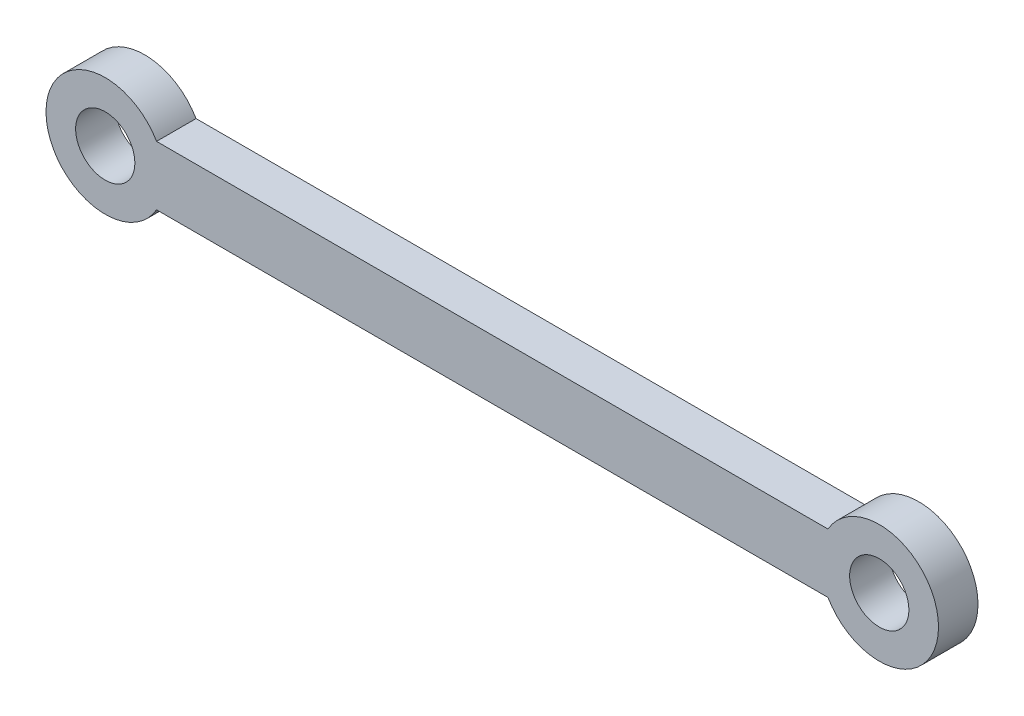
ISO-10303-21;
HEADER;
FILE_DESCRIPTION(('STEP AP214'),'2;1');
FILE_NAME('part.step','',(''),(''),'','','');
FILE_SCHEMA(('AUTOMOTIVE_DESIGN { 1 0 10303 214 1 1 1 1 }'));
ENDSEC;
DATA;
#1=APPLICATION_CONTEXT('core data for automotive mechanical design processes');
#2=APPLICATION_PROTOCOL_DEFINITION('international standard','automotive_design',2000,#1);
#3=PRODUCT_CONTEXT('',#1,'mechanical');
#4=PRODUCT('Part','Part','',(#3));
#5=PRODUCT_RELATED_PRODUCT_CATEGORY('part','',(#4));
#6=PRODUCT_DEFINITION_FORMATION('','',#4);
#7=PRODUCT_DEFINITION_CONTEXT('part definition',#1,'design');
#8=PRODUCT_DEFINITION('design','',#6,#7);
#9=PRODUCT_DEFINITION_SHAPE('','',#8);
#10=(LENGTH_UNIT() NAMED_UNIT(*) SI_UNIT(.MILLI.,.METRE.));
#11=(NAMED_UNIT(*) PLANE_ANGLE_UNIT() SI_UNIT($,.RADIAN.));
#12=(NAMED_UNIT(*) SI_UNIT($,.STERADIAN.) SOLID_ANGLE_UNIT());
#13=UNCERTAINTY_MEASURE_WITH_UNIT(LENGTH_MEASURE(1.E-05),#10,'distance_accuracy_value','');
#14=(GEOMETRIC_REPRESENTATION_CONTEXT(3) GLOBAL_UNCERTAINTY_ASSIGNED_CONTEXT((#13)) GLOBAL_UNIT_ASSIGNED_CONTEXT((#10,
#11,#12)) REPRESENTATION_CONTEXT('',''));
#15=CARTESIAN_POINT('',(0.,0.,0.));
#16=DIRECTION('',(0.,0.,1.));
#17=DIRECTION('',(1.,0.,0.));
#18=AXIS2_PLACEMENT_3D('',#15,#16,#17);
#19=CARTESIAN_POINT('',(-2.59807621135332,1.5,2.));
#20=DIRECTION('',(0.,0.,-1.));
#21=DIRECTION('',(-1.,0.,0.));
#22=AXIS2_PLACEMENT_3D('',#19,#20,#21);
#23=PLANE('',#22);
#24=CARTESIAN_POINT('',(-2.59807621135332,1.5,2.));
#25=DIRECTION('',(0.,0.,1.));
#26=DIRECTION('',(-1.,0.,0.));
#27=AXIS2_PLACEMENT_3D('',#24,#25,#26);
#28=CIRCLE('',#27,3.);
#29=CARTESIAN_POINT('',(0.,3.,2.));
#30=VERTEX_POINT('',#29);
#31=CARTESIAN_POINT('',(0.,0.,2.));
#32=VERTEX_POINT('',#31);
#33=EDGE_CURVE('E85',#30,#32,#28,.T.);
#34=ORIENTED_EDGE('',*,*,#33,.T.);
#35=DIRECTION('',(1.,0.,0.));
#36=VECTOR('',#35,1.);
#37=CARTESIAN_POINT('',(0.,0.,2.));
#38=LINE('',#37,#36);
#39=CARTESIAN_POINT('',(34.,0.,2.));
#40=VERTEX_POINT('',#39);
#41=EDGE_CURVE('E80',#32,#40,#38,.T.);
#42=ORIENTED_EDGE('',*,*,#41,.T.);
#43=CARTESIAN_POINT('',(36.5980762113533,1.5,2.));
#44=DIRECTION('',(0.,0.,1.));
#45=DIRECTION('',(-1.,0.,0.));
#46=AXIS2_PLACEMENT_3D('',#43,#44,#45);
#47=CIRCLE('',#46,3.);
#48=CARTESIAN_POINT('',(34.,3.,2.));
#49=VERTEX_POINT('',#48);
#50=EDGE_CURVE('E83',#40,#49,#47,.T.);
#51=ORIENTED_EDGE('',*,*,#50,.T.);
#52=DIRECTION('',(-1.,0.,0.));
#53=VECTOR('',#52,1.);
#54=CARTESIAN_POINT('',(0.,3.,2.));
#55=LINE('',#54,#53);
#56=EDGE_CURVE('E50',#49,#30,#55,.T.);
#57=ORIENTED_EDGE('',*,*,#56,.T.);
#58=EDGE_LOOP('',(#34,#42,#51,#57));
#59=FACE_BOUND('',#58,.T.);
#60=CARTESIAN_POINT('',(36.5980762113533,1.5,2.));
#61=DIRECTION('',(0.,0.,1.));
#62=DIRECTION('',(1.,0.,0.));
#63=AXIS2_PLACEMENT_3D('',#60,#61,#62);
#64=CIRCLE('',#63,1.5);
#65=CARTESIAN_POINT('',(38.0980762113533,1.5,2.));
#66=VERTEX_POINT('',#65);
#67=EDGE_CURVE('E100',#66,#66,#64,.T.);
#68=ORIENTED_EDGE('',*,*,#67,.F.);
#69=EDGE_LOOP('',(#68));
#70=FACE_BOUND('',#69,.T.);
#71=CARTESIAN_POINT('',(-2.59807621135332,1.5,2.));
#72=DIRECTION('',(0.,0.,1.));
#73=DIRECTION('',(1.,0.,0.));
#74=AXIS2_PLACEMENT_3D('',#71,#72,#73);
#75=CIRCLE('',#74,1.5);
#76=CARTESIAN_POINT('',(-1.09807621135332,1.5,2.));
#77=VERTEX_POINT('',#76);
#78=EDGE_CURVE('E115',#77,#77,#75,.T.);
#79=ORIENTED_EDGE('',*,*,#78,.F.);
#80=EDGE_LOOP('',(#79));
#81=FACE_BOUND('',#80,.T.);
#82=ADVANCED_FACE('F33',(#59,#70,#81),#23,.F.);
#83=CARTESIAN_POINT('',(-2.59807621135332,1.5,0.));
#84=DIRECTION('',(0.,0.,-1.));
#85=DIRECTION('',(-1.,0.,0.));
#86=AXIS2_PLACEMENT_3D('',#83,#84,#85);
#87=PLANE('',#86);
#88=CARTESIAN_POINT('',(36.5980762113533,1.5,0.));
#89=DIRECTION('',(0.,0.,1.));
#90=DIRECTION('',(1.,0.,0.));
#91=AXIS2_PLACEMENT_3D('',#88,#89,#90);
#92=CIRCLE('',#91,1.5);
#93=CARTESIAN_POINT('',(38.0980762113533,1.5,0.));
#94=VERTEX_POINT('',#93);
#95=EDGE_CURVE('E112',#94,#94,#92,.T.);
#96=ORIENTED_EDGE('',*,*,#95,.T.);
#97=EDGE_LOOP('',(#96));
#98=FACE_BOUND('',#97,.T.);
#99=CARTESIAN_POINT('',(-2.59807621135332,1.5,0.));
#100=DIRECTION('',(0.,0.,1.));
#101=DIRECTION('',(-1.,0.,0.));
#102=AXIS2_PLACEMENT_3D('',#99,#100,#101);
#103=CIRCLE('',#102,3.);
#104=CARTESIAN_POINT('',(0.,3.,0.));
#105=VERTEX_POINT('',#104);
#106=CARTESIAN_POINT('',(0.,0.,0.));
#107=VERTEX_POINT('',#106);
#108=EDGE_CURVE('E97',#105,#107,#103,.T.);
#109=ORIENTED_EDGE('',*,*,#108,.F.);
#110=DIRECTION('',(-1.,0.,0.));
#111=VECTOR('',#110,1.);
#112=CARTESIAN_POINT('',(0.,3.,0.));
#113=LINE('',#112,#111);
#114=CARTESIAN_POINT('',(34.,3.,0.));
#115=VERTEX_POINT('',#114);
#116=EDGE_CURVE('E73',#115,#105,#113,.T.);
#117=ORIENTED_EDGE('',*,*,#116,.F.);
#118=CARTESIAN_POINT('',(36.5980762113533,1.5,0.));
#119=DIRECTION('',(0.,0.,1.));
#120=DIRECTION('',(-1.,0.,0.));
#121=AXIS2_PLACEMENT_3D('',#118,#119,#120);
#122=CIRCLE('',#121,3.);
#123=CARTESIAN_POINT('',(34.,0.,0.));
#124=VERTEX_POINT('',#123);
#125=EDGE_CURVE('E67',#124,#115,#122,.T.);
#126=ORIENTED_EDGE('',*,*,#125,.F.);
#127=DIRECTION('',(1.,0.,0.));
#128=VECTOR('',#127,1.);
#129=CARTESIAN_POINT('',(0.,0.,0.));
#130=LINE('',#129,#128);
#131=EDGE_CURVE('E89',#107,#124,#130,.T.);
#132=ORIENTED_EDGE('',*,*,#131,.F.);
#133=EDGE_LOOP('',(#109,#117,#126,#132));
#134=FACE_BOUND('',#133,.T.);
#135=CARTESIAN_POINT('',(-2.59807621135332,1.5,0.));
#136=DIRECTION('',(0.,0.,1.));
#137=DIRECTION('',(1.,0.,0.));
#138=AXIS2_PLACEMENT_3D('',#135,#136,#137);
#139=CIRCLE('',#138,1.5);
#140=CARTESIAN_POINT('',(-1.09807621135332,1.5,0.));
#141=VERTEX_POINT('',#140);
#142=EDGE_CURVE('E118',#141,#141,#139,.T.);
#143=ORIENTED_EDGE('',*,*,#142,.T.);
#144=EDGE_LOOP('',(#143));
#145=FACE_BOUND('',#144,.T.);
#146=ADVANCED_FACE('F108',(#98,#134,#145),#87,.T.);
#147=CARTESIAN_POINT('',(-2.59807621135332,1.5,2.));
#148=DIRECTION('',(0.,0.,-1.));
#149=DIRECTION('',(-1.,0.,0.));
#150=AXIS2_PLACEMENT_3D('',#147,#148,#149);
#151=CYLINDRICAL_SURFACE('',#150,3.);
#152=ORIENTED_EDGE('',*,*,#108,.T.);
#153=DIRECTION('',(0.,0.,-1.));
#154=VECTOR('',#153,1.);
#155=CARTESIAN_POINT('',(0.,0.,2.));
#156=LINE('',#155,#154);
#157=EDGE_CURVE('E11',#32,#107,#156,.T.);
#158=ORIENTED_EDGE('',*,*,#157,.F.);
#159=ORIENTED_EDGE('',*,*,#33,.F.);
#160=DIRECTION('',(0.,0.,-1.));
#161=VECTOR('',#160,1.);
#162=CARTESIAN_POINT('',(0.,3.,2.));
#163=LINE('',#162,#161);
#164=EDGE_CURVE('E93',#30,#105,#163,.T.);
#165=ORIENTED_EDGE('',*,*,#164,.T.);
#166=EDGE_LOOP('',(#152,#158,#159,#165));
#167=FACE_BOUND('',#166,.T.);
#168=ADVANCED_FACE('F35',(#167),#151,.T.);
#169=CARTESIAN_POINT('',(0.,0.,2.));
#170=DIRECTION('',(0.,1.,0.));
#171=DIRECTION('',(0.,0.,1.));
#172=AXIS2_PLACEMENT_3D('',#169,#170,#171);
#173=PLANE('',#172);
#174=ORIENTED_EDGE('',*,*,#131,.T.);
#175=DIRECTION('',(0.,0.,-1.));
#176=VECTOR('',#175,1.);
#177=CARTESIAN_POINT('',(34.,0.,2.));
#178=LINE('',#177,#176);
#179=EDGE_CURVE('E42',#40,#124,#178,.T.);
#180=ORIENTED_EDGE('',*,*,#179,.F.);
#181=ORIENTED_EDGE('',*,*,#41,.F.);
#182=ORIENTED_EDGE('',*,*,#157,.T.);
#183=EDGE_LOOP('',(#174,#180,#181,#182));
#184=FACE_BOUND('',#183,.T.);
#185=ADVANCED_FACE('F88',(#184),#173,.F.);
#186=CARTESIAN_POINT('',(36.5980762113533,1.5,2.));
#187=DIRECTION('',(0.,0.,-1.));
#188=DIRECTION('',(-1.,0.,0.));
#189=AXIS2_PLACEMENT_3D('',#186,#187,#188);
#190=CYLINDRICAL_SURFACE('',#189,3.);
#191=ORIENTED_EDGE('',*,*,#125,.T.);
#192=DIRECTION('',(0.,0.,-1.));
#193=VECTOR('',#192,1.);
#194=CARTESIAN_POINT('',(34.,3.,2.));
#195=LINE('',#194,#193);
#196=EDGE_CURVE('E90',#49,#115,#195,.T.);
#197=ORIENTED_EDGE('',*,*,#196,.F.);
#198=ORIENTED_EDGE('',*,*,#50,.F.);
#199=ORIENTED_EDGE('',*,*,#179,.T.);
#200=EDGE_LOOP('',(#191,#197,#198,#199));
#201=FACE_BOUND('',#200,.T.);
#202=ADVANCED_FACE('F91',(#201),#190,.T.);
#203=CARTESIAN_POINT('',(0.,3.,2.));
#204=DIRECTION('',(0.,-1.,0.));
#205=DIRECTION('',(0.,0.,-1.));
#206=AXIS2_PLACEMENT_3D('',#203,#204,#205);
#207=PLANE('',#206);
#208=ORIENTED_EDGE('',*,*,#116,.T.);
#209=ORIENTED_EDGE('',*,*,#164,.F.);
#210=ORIENTED_EDGE('',*,*,#56,.F.);
#211=ORIENTED_EDGE('',*,*,#196,.T.);
#212=EDGE_LOOP('',(#208,#209,#210,#211));
#213=FACE_BOUND('',#212,.T.);
#214=ADVANCED_FACE('F105',(#213),#207,.F.);
#215=CARTESIAN_POINT('',(36.5980762113533,1.5,2.));
#216=DIRECTION('',(0.,0.,-1.));
#217=DIRECTION('',(-1.,0.,0.));
#218=AXIS2_PLACEMENT_3D('',#215,#216,#217);
#219=CYLINDRICAL_SURFACE('',#218,1.5);
#220=ORIENTED_EDGE('',*,*,#67,.T.);
#221=EDGE_LOOP('',(#220));
#222=FACE_BOUND('',#221,.T.);
#223=ORIENTED_EDGE('',*,*,#95,.F.);
#224=EDGE_LOOP('',(#223));
#225=FACE_BOUND('',#224,.T.);
#226=ADVANCED_FACE('F135',(#222,#225),#219,.F.);
#227=CARTESIAN_POINT('',(-2.59807621135332,1.5,2.));
#228=DIRECTION('',(0.,0.,-1.));
#229=DIRECTION('',(-1.,0.,0.));
#230=AXIS2_PLACEMENT_3D('',#227,#228,#229);
#231=CYLINDRICAL_SURFACE('',#230,1.5);
#232=ORIENTED_EDGE('',*,*,#78,.T.);
#233=EDGE_LOOP('',(#232));
#234=FACE_BOUND('',#233,.T.);
#235=ORIENTED_EDGE('',*,*,#142,.F.);
#236=EDGE_LOOP('',(#235));
#237=FACE_BOUND('',#236,.T.);
#238=ADVANCED_FACE('F124',(#234,#237),#231,.F.);
#239=CLOSED_SHELL('',(#82,#146,#168,#185,#202,#214,#226,#238));
#240=MANIFOLD_SOLID_BREP('B2',#239);
#241=ADVANCED_BREP_SHAPE_REPRESENTATION('',(#18,#240),#14);
#242=SHAPE_DEFINITION_REPRESENTATION(#9,#241);
ENDSEC;
END-ISO-10303-21;
